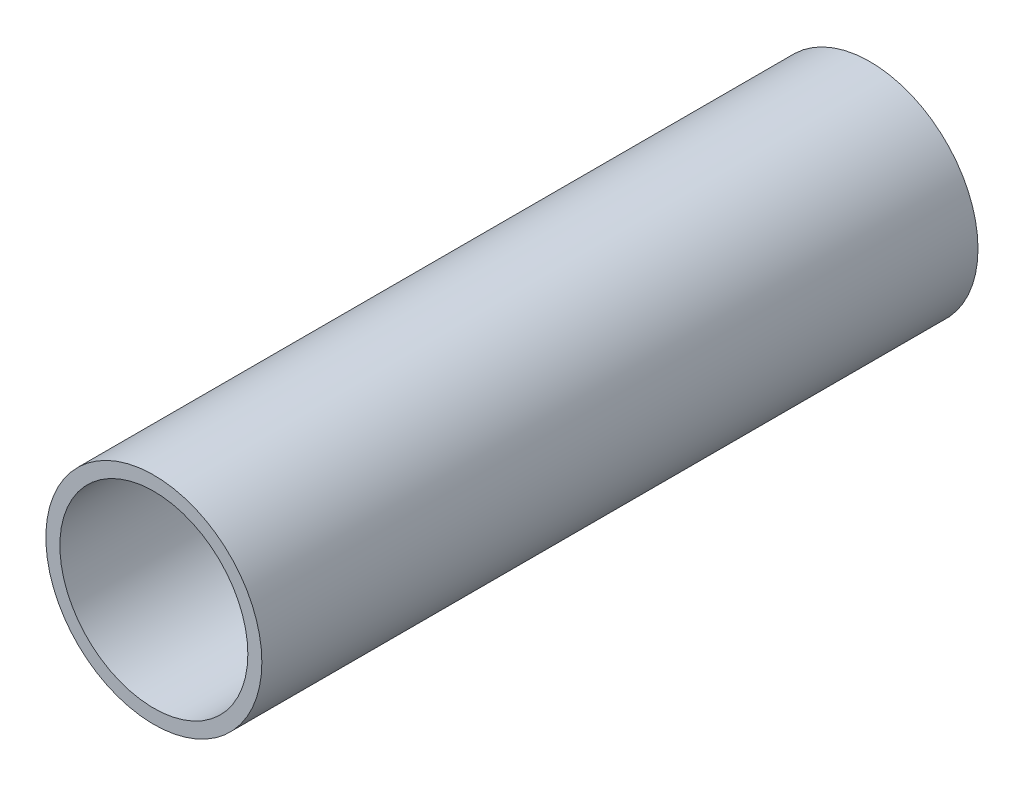
ISO-10303-21;
HEADER;
FILE_DESCRIPTION(('STEP AP214'),'2;1');
FILE_NAME('part.step','',(''),(''),'','','');
FILE_SCHEMA(('AUTOMOTIVE_DESIGN { 1 0 10303 214 1 1 1 1 }'));
ENDSEC;
DATA;
#1=APPLICATION_CONTEXT('core data for automotive mechanical design processes');
#2=APPLICATION_PROTOCOL_DEFINITION('international standard','automotive_design',2000,#1);
#3=PRODUCT_CONTEXT('',#1,'mechanical');
#4=PRODUCT('Part','Part','',(#3));
#5=PRODUCT_RELATED_PRODUCT_CATEGORY('part','',(#4));
#6=PRODUCT_DEFINITION_FORMATION('','',#4);
#7=PRODUCT_DEFINITION_CONTEXT('part definition',#1,'design');
#8=PRODUCT_DEFINITION('design','',#6,#7);
#9=PRODUCT_DEFINITION_SHAPE('','',#8);
#10=(LENGTH_UNIT() NAMED_UNIT(*) SI_UNIT(.MILLI.,.METRE.));
#11=(NAMED_UNIT(*) PLANE_ANGLE_UNIT() SI_UNIT($,.RADIAN.));
#12=(NAMED_UNIT(*) SI_UNIT($,.STERADIAN.) SOLID_ANGLE_UNIT());
#13=UNCERTAINTY_MEASURE_WITH_UNIT(LENGTH_MEASURE(1.E-05),#10,'distance_accuracy_value','');
#14=(GEOMETRIC_REPRESENTATION_CONTEXT(3) GLOBAL_UNCERTAINTY_ASSIGNED_CONTEXT((#13)) GLOBAL_UNIT_ASSIGNED_CONTEXT((#10,
#11,#12)) REPRESENTATION_CONTEXT('',''));
#15=CARTESIAN_POINT('',(0.,0.,0.));
#16=DIRECTION('',(0.,0.,1.));
#17=DIRECTION('',(1.,0.,0.));
#18=AXIS2_PLACEMENT_3D('',#15,#16,#17);
#19=CARTESIAN_POINT('',(0.,0.,100.));
#20=DIRECTION('',(0.,0.,1.));
#21=DIRECTION('',(1.,0.,0.));
#22=AXIS2_PLACEMENT_3D('',#19,#20,#21);
#23=PLANE('',#22);
#24=CARTESIAN_POINT('',(0.,0.,100.));
#25=DIRECTION('',(0.,0.,1.));
#26=DIRECTION('',(1.,0.,0.));
#27=AXIS2_PLACEMENT_3D('',#24,#25,#26);
#28=CIRCLE('',#27,30.1625);
#29=CARTESIAN_POINT('',(30.1625,0.,100.));
#30=VERTEX_POINT('',#29);
#31=EDGE_CURVE('E11',#30,#30,#28,.T.);
#32=ORIENTED_EDGE('',*,*,#31,.T.);
#33=EDGE_LOOP('',(#32));
#34=FACE_BOUND('',#33,.T.);
#35=CARTESIAN_POINT('',(0.,0.,100.));
#36=DIRECTION('',(0.,0.,1.));
#37=DIRECTION('',(1.,0.,0.));
#38=AXIS2_PLACEMENT_3D('',#35,#36,#37);
#39=CIRCLE('',#38,26.2509);
#40=CARTESIAN_POINT('',(26.2509,0.,100.));
#41=VERTEX_POINT('',#40);
#42=EDGE_CURVE('E48',#41,#41,#39,.T.);
#43=ORIENTED_EDGE('',*,*,#42,.F.);
#44=EDGE_LOOP('',(#43));
#45=FACE_BOUND('',#44,.T.);
#46=ADVANCED_FACE('F37',(#34,#45),#23,.T.);
#47=CARTESIAN_POINT('',(0.,0.,-100.));
#48=DIRECTION('',(0.,0.,1.));
#49=DIRECTION('',(1.,0.,0.));
#50=AXIS2_PLACEMENT_3D('',#47,#48,#49);
#51=PLANE('',#50);
#52=CARTESIAN_POINT('',(0.,0.,-100.));
#53=DIRECTION('',(0.,0.,1.));
#54=DIRECTION('',(1.,0.,0.));
#55=AXIS2_PLACEMENT_3D('',#52,#53,#54);
#56=CIRCLE('',#55,30.1625);
#57=CARTESIAN_POINT('',(30.1625,0.,-100.));
#58=VERTEX_POINT('',#57);
#59=EDGE_CURVE('E41',#58,#58,#56,.T.);
#60=ORIENTED_EDGE('',*,*,#59,.F.);
#61=EDGE_LOOP('',(#60));
#62=FACE_BOUND('',#61,.T.);
#63=CARTESIAN_POINT('',(0.,0.,-100.));
#64=DIRECTION('',(0.,0.,1.));
#65=DIRECTION('',(1.,0.,0.));
#66=AXIS2_PLACEMENT_3D('',#63,#64,#65);
#67=CIRCLE('',#66,26.2509);
#68=CARTESIAN_POINT('',(26.2509,0.,-100.));
#69=VERTEX_POINT('',#68);
#70=EDGE_CURVE('E50',#69,#69,#67,.T.);
#71=ORIENTED_EDGE('',*,*,#70,.T.);
#72=EDGE_LOOP('',(#71));
#73=FACE_BOUND('',#72,.T.);
#74=ADVANCED_FACE('F60',(#62,#73),#51,.F.);
#75=CARTESIAN_POINT('',(0.,0.,100.));
#76=DIRECTION('',(0.,0.,-1.));
#77=DIRECTION('',(-1.,0.,0.));
#78=AXIS2_PLACEMENT_3D('',#75,#76,#77);
#79=CYLINDRICAL_SURFACE('',#78,30.1625);
#80=ORIENTED_EDGE('',*,*,#31,.F.);
#81=EDGE_LOOP('',(#80));
#82=FACE_BOUND('',#81,.T.);
#83=ORIENTED_EDGE('',*,*,#59,.T.);
#84=EDGE_LOOP('',(#83));
#85=FACE_BOUND('',#84,.T.);
#86=ADVANCED_FACE('F39',(#82,#85),#79,.T.);
#87=CARTESIAN_POINT('',(0.,0.,100.));
#88=DIRECTION('',(0.,0.,-1.));
#89=DIRECTION('',(-1.,0.,0.));
#90=AXIS2_PLACEMENT_3D('',#87,#88,#89);
#91=CYLINDRICAL_SURFACE('',#90,26.2509);
#92=ORIENTED_EDGE('',*,*,#42,.T.);
#93=EDGE_LOOP('',(#92));
#94=FACE_BOUND('',#93,.T.);
#95=ORIENTED_EDGE('',*,*,#70,.F.);
#96=EDGE_LOOP('',(#95));
#97=FACE_BOUND('',#96,.T.);
#98=ADVANCED_FACE('F56',(#94,#97),#91,.F.);
#99=CLOSED_SHELL('',(#46,#74,#86,#98));
#100=MANIFOLD_SOLID_BREP('B2',#99);
#101=ADVANCED_BREP_SHAPE_REPRESENTATION('',(#18,#100),#14);
#102=SHAPE_DEFINITION_REPRESENTATION(#9,#101);
ENDSEC;
END-ISO-10303-21;
